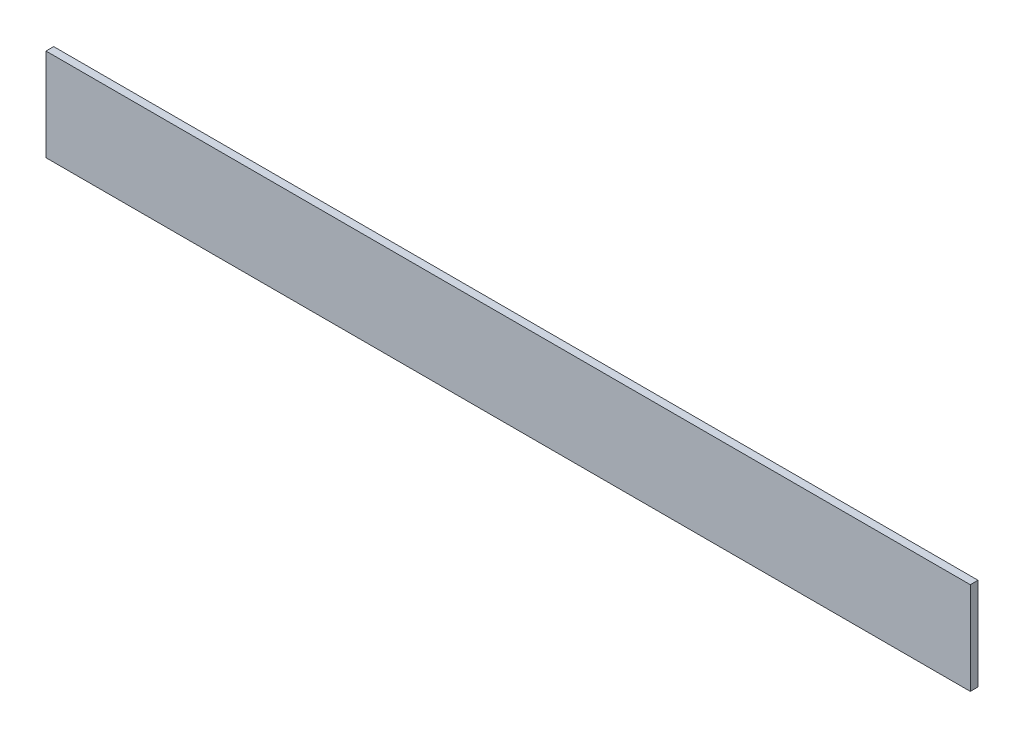
ISO-10303-21;
HEADER;
FILE_DESCRIPTION(('STEP AP214'),'2;1');
FILE_NAME('part.step','',(''),(''),'','','');
FILE_SCHEMA(('AUTOMOTIVE_DESIGN { 1 0 10303 214 1 1 1 1 }'));
ENDSEC;
DATA;
#1=APPLICATION_CONTEXT('core data for automotive mechanical design processes');
#2=APPLICATION_PROTOCOL_DEFINITION('international standard','automotive_design',2000,#1);
#3=PRODUCT_CONTEXT('',#1,'mechanical');
#4=PRODUCT('Part','Part','',(#3));
#5=PRODUCT_RELATED_PRODUCT_CATEGORY('part','',(#4));
#6=PRODUCT_DEFINITION_FORMATION('','',#4);
#7=PRODUCT_DEFINITION_CONTEXT('part definition',#1,'design');
#8=PRODUCT_DEFINITION('design','',#6,#7);
#9=PRODUCT_DEFINITION_SHAPE('','',#8);
#10=(LENGTH_UNIT() NAMED_UNIT(*) SI_UNIT(.MILLI.,.METRE.));
#11=(NAMED_UNIT(*) PLANE_ANGLE_UNIT() SI_UNIT($,.RADIAN.));
#12=(NAMED_UNIT(*) SI_UNIT($,.STERADIAN.) SOLID_ANGLE_UNIT());
#13=UNCERTAINTY_MEASURE_WITH_UNIT(LENGTH_MEASURE(1.E-05),#10,'distance_accuracy_value','');
#14=(GEOMETRIC_REPRESENTATION_CONTEXT(3) GLOBAL_UNCERTAINTY_ASSIGNED_CONTEXT((#13)) GLOBAL_UNIT_ASSIGNED_CONTEXT((#10,
#11,#12)) REPRESENTATION_CONTEXT('',''));
#15=CARTESIAN_POINT('',(0.,0.,0.));
#16=DIRECTION('',(0.,0.,1.));
#17=DIRECTION('',(1.,0.,0.));
#18=AXIS2_PLACEMENT_3D('',#15,#16,#17);
#19=CARTESIAN_POINT('',(762.,-38.1,-3.175));
#20=DIRECTION('',(0.,0.,1.));
#21=DIRECTION('',(1.,0.,0.));
#22=AXIS2_PLACEMENT_3D('',#19,#20,#21);
#23=PLANE('',#22);
#24=DIRECTION('',(0.,1.,0.));
#25=VECTOR('',#24,1.);
#26=CARTESIAN_POINT('',(0.,-38.1,-3.175));
#27=LINE('',#26,#25);
#28=CARTESIAN_POINT('',(0.,-38.1,-3.175));
#29=VERTEX_POINT('',#28);
#30=CARTESIAN_POINT('',(0.,38.1,-3.175));
#31=VERTEX_POINT('',#30);
#32=EDGE_CURVE('E98',#29,#31,#27,.T.);
#33=ORIENTED_EDGE('',*,*,#32,.T.);
#34=DIRECTION('',(-1.,0.,0.));
#35=VECTOR('',#34,1.);
#36=CARTESIAN_POINT('',(762.,38.1,-3.175));
#37=LINE('',#36,#35);
#38=CARTESIAN_POINT('',(762.,38.1,-3.175));
#39=VERTEX_POINT('',#38);
#40=EDGE_CURVE('E11',#39,#31,#37,.T.);
#41=ORIENTED_EDGE('',*,*,#40,.F.);
#42=DIRECTION('',(0.,1.,0.));
#43=VECTOR('',#42,1.);
#44=CARTESIAN_POINT('',(762.,-38.1,-3.175));
#45=LINE('',#44,#43);
#46=CARTESIAN_POINT('',(762.,-38.1,-3.175));
#47=VERTEX_POINT('',#46);
#48=EDGE_CURVE('E86',#47,#39,#45,.T.);
#49=ORIENTED_EDGE('',*,*,#48,.F.);
#50=DIRECTION('',(-1.,0.,0.));
#51=VECTOR('',#50,1.);
#52=CARTESIAN_POINT('',(762.,-38.1,-3.175));
#53=LINE('',#52,#51);
#54=EDGE_CURVE('E94',#47,#29,#53,.T.);
#55=ORIENTED_EDGE('',*,*,#54,.T.);
#56=EDGE_LOOP('',(#33,#41,#49,#55));
#57=FACE_BOUND('',#56,.T.);
#58=ADVANCED_FACE('F35',(#57),#23,.F.);
#59=CARTESIAN_POINT('',(762.,38.1,3.175));
#60=DIRECTION('',(0.,-1.,0.));
#61=DIRECTION('',(0.,0.,-1.));
#62=AXIS2_PLACEMENT_3D('',#59,#60,#61);
#63=PLANE('',#62);
#64=DIRECTION('',(0.,0.,1.));
#65=VECTOR('',#64,1.);
#66=CARTESIAN_POINT('',(0.,38.1,3.175));
#67=LINE('',#66,#65);
#68=CARTESIAN_POINT('',(0.,38.1,3.175));
#69=VERTEX_POINT('',#68);
#70=EDGE_CURVE('E90',#31,#69,#67,.T.);
#71=ORIENTED_EDGE('',*,*,#70,.T.);
#72=DIRECTION('',(-1.,0.,0.));
#73=VECTOR('',#72,1.);
#74=CARTESIAN_POINT('',(762.,38.1,3.175));
#75=LINE('',#74,#73);
#76=CARTESIAN_POINT('',(762.,38.1,3.175));
#77=VERTEX_POINT('',#76);
#78=EDGE_CURVE('E43',#77,#69,#75,.T.);
#79=ORIENTED_EDGE('',*,*,#78,.F.);
#80=DIRECTION('',(0.,0.,1.));
#81=VECTOR('',#80,1.);
#82=CARTESIAN_POINT('',(762.,38.1,3.175));
#83=LINE('',#82,#81);
#84=EDGE_CURVE('E81',#39,#77,#83,.T.);
#85=ORIENTED_EDGE('',*,*,#84,.F.);
#86=ORIENTED_EDGE('',*,*,#40,.T.);
#87=EDGE_LOOP('',(#71,#79,#85,#86));
#88=FACE_BOUND('',#87,.T.);
#89=ADVANCED_FACE('F89',(#88),#63,.F.);
#90=CARTESIAN_POINT('',(762.,-38.1,3.175));
#91=DIRECTION('',(0.,0.,-1.));
#92=DIRECTION('',(-1.,0.,0.));
#93=AXIS2_PLACEMENT_3D('',#90,#91,#92);
#94=PLANE('',#93);
#95=DIRECTION('',(0.,-1.,0.));
#96=VECTOR('',#95,1.);
#97=CARTESIAN_POINT('',(0.,-38.1,3.175));
#98=LINE('',#97,#96);
#99=CARTESIAN_POINT('',(0.,-38.1,3.175));
#100=VERTEX_POINT('',#99);
#101=EDGE_CURVE('E68',#69,#100,#98,.T.);
#102=ORIENTED_EDGE('',*,*,#101,.T.);
#103=DIRECTION('',(-1.,0.,0.));
#104=VECTOR('',#103,1.);
#105=CARTESIAN_POINT('',(762.,-38.1,3.175));
#106=LINE('',#105,#104);
#107=CARTESIAN_POINT('',(762.,-38.1,3.175));
#108=VERTEX_POINT('',#107);
#109=EDGE_CURVE('E91',#108,#100,#106,.T.);
#110=ORIENTED_EDGE('',*,*,#109,.F.);
#111=DIRECTION('',(0.,-1.,0.));
#112=VECTOR('',#111,1.);
#113=CARTESIAN_POINT('',(762.,-38.1,3.175));
#114=LINE('',#113,#112);
#115=EDGE_CURVE('E84',#77,#108,#114,.T.);
#116=ORIENTED_EDGE('',*,*,#115,.F.);
#117=ORIENTED_EDGE('',*,*,#78,.T.);
#118=EDGE_LOOP('',(#102,#110,#116,#117));
#119=FACE_BOUND('',#118,.T.);
#120=ADVANCED_FACE('F92',(#119),#94,.F.);
#121=CARTESIAN_POINT('',(762.,-38.1,3.175));
#122=DIRECTION('',(0.,1.,0.));
#123=DIRECTION('',(0.,0.,1.));
#124=AXIS2_PLACEMENT_3D('',#121,#122,#123);
#125=PLANE('',#124);
#126=DIRECTION('',(0.,0.,-1.));
#127=VECTOR('',#126,1.);
#128=CARTESIAN_POINT('',(0.,-38.1,3.175));
#129=LINE('',#128,#127);
#130=EDGE_CURVE('E74',#100,#29,#129,.T.);
#131=ORIENTED_EDGE('',*,*,#130,.T.);
#132=ORIENTED_EDGE('',*,*,#54,.F.);
#133=DIRECTION('',(0.,0.,-1.));
#134=VECTOR('',#133,1.);
#135=CARTESIAN_POINT('',(762.,-38.1,3.175));
#136=LINE('',#135,#134);
#137=EDGE_CURVE('E51',#108,#47,#136,.T.);
#138=ORIENTED_EDGE('',*,*,#137,.F.);
#139=ORIENTED_EDGE('',*,*,#109,.T.);
#140=EDGE_LOOP('',(#131,#132,#138,#139));
#141=FACE_BOUND('',#140,.T.);
#142=ADVANCED_FACE('F105',(#141),#125,.F.);
#143=CARTESIAN_POINT('',(762.,0.,0.));
#144=DIRECTION('',(-1.,0.,0.));
#145=DIRECTION('',(0.,0.,1.));
#146=AXIS2_PLACEMENT_3D('',#143,#144,#145);
#147=PLANE('',#146);
#148=ORIENTED_EDGE('',*,*,#48,.T.);
#149=ORIENTED_EDGE('',*,*,#84,.T.);
#150=ORIENTED_EDGE('',*,*,#115,.T.);
#151=ORIENTED_EDGE('',*,*,#137,.T.);
#152=EDGE_LOOP('',(#148,#149,#150,#151));
#153=FACE_BOUND('',#152,.T.);
#154=ADVANCED_FACE('F82',(#153),#147,.F.);
#155=CARTESIAN_POINT('',(0.,0.,0.));
#156=DIRECTION('',(-1.,0.,0.));
#157=DIRECTION('',(0.,0.,1.));
#158=AXIS2_PLACEMENT_3D('',#155,#156,#157);
#159=PLANE('',#158);
#160=ORIENTED_EDGE('',*,*,#32,.F.);
#161=ORIENTED_EDGE('',*,*,#130,.F.);
#162=ORIENTED_EDGE('',*,*,#101,.F.);
#163=ORIENTED_EDGE('',*,*,#70,.F.);
#164=EDGE_LOOP('',(#160,#161,#162,#163));
#165=FACE_BOUND('',#164,.T.);
#166=ADVANCED_FACE('F108',(#165),#159,.T.);
#167=CLOSED_SHELL('',(#58,#89,#120,#142,#154,#166));
#168=MANIFOLD_SOLID_BREP('B2',#167);
#169=ADVANCED_BREP_SHAPE_REPRESENTATION('',(#18,#168),#14);
#170=SHAPE_DEFINITION_REPRESENTATION(#9,#169);
ENDSEC;
END-ISO-10303-21;
